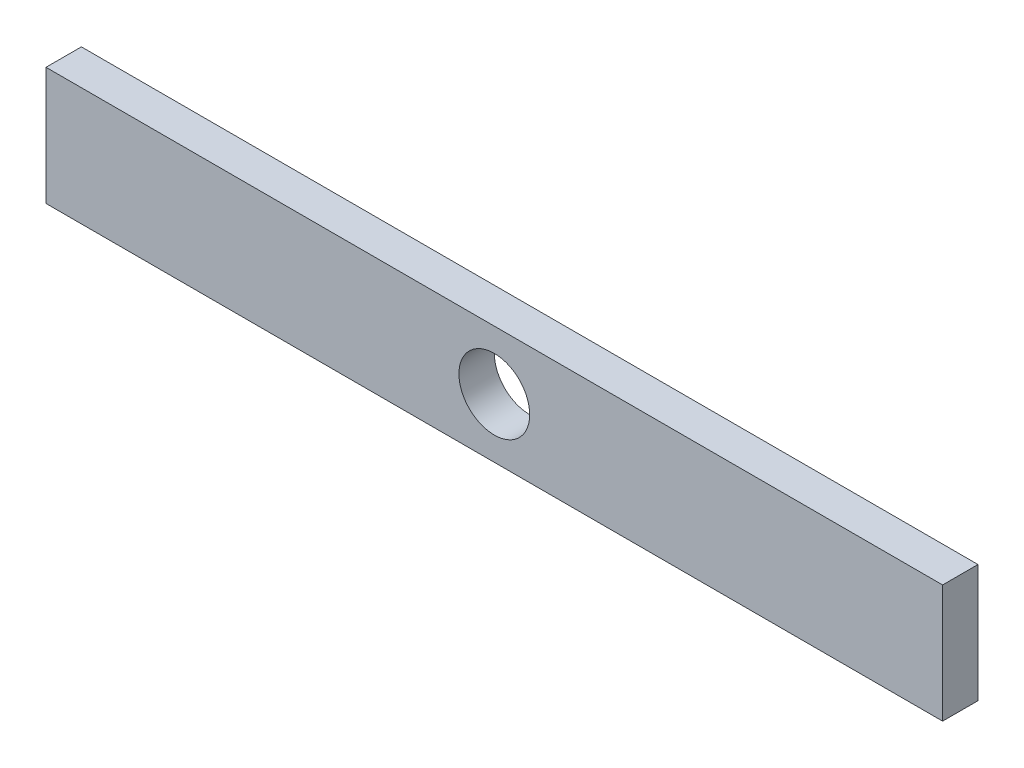
ISO-10303-21;
HEADER;
FILE_DESCRIPTION(('STEP AP214'),'2;1');
FILE_NAME('part.step','',(''),(''),'','','');
FILE_SCHEMA(('AUTOMOTIVE_DESIGN { 1 0 10303 214 1 1 1 1 }'));
ENDSEC;
DATA;
#1=APPLICATION_CONTEXT('core data for automotive mechanical design processes');
#2=APPLICATION_PROTOCOL_DEFINITION('international standard','automotive_design',2000,#1);
#3=PRODUCT_CONTEXT('',#1,'mechanical');
#4=PRODUCT('Part','Part','',(#3));
#5=PRODUCT_RELATED_PRODUCT_CATEGORY('part','',(#4));
#6=PRODUCT_DEFINITION_FORMATION('','',#4);
#7=PRODUCT_DEFINITION_CONTEXT('part definition',#1,'design');
#8=PRODUCT_DEFINITION('design','',#6,#7);
#9=PRODUCT_DEFINITION_SHAPE('','',#8);
#10=(LENGTH_UNIT() NAMED_UNIT(*) SI_UNIT(.MILLI.,.METRE.));
#11=(NAMED_UNIT(*) PLANE_ANGLE_UNIT() SI_UNIT($,.RADIAN.));
#12=(NAMED_UNIT(*) SI_UNIT($,.STERADIAN.) SOLID_ANGLE_UNIT());
#13=UNCERTAINTY_MEASURE_WITH_UNIT(LENGTH_MEASURE(1.E-05),#10,'distance_accuracy_value','');
#14=(GEOMETRIC_REPRESENTATION_CONTEXT(3) GLOBAL_UNCERTAINTY_ASSIGNED_CONTEXT((#13)) GLOBAL_UNIT_ASSIGNED_CONTEXT((#10,
#11,#12)) REPRESENTATION_CONTEXT('',''));
#15=CARTESIAN_POINT('',(0.,0.,0.));
#16=DIRECTION('',(0.,0.,1.));
#17=DIRECTION('',(1.,0.,0.));
#18=AXIS2_PLACEMENT_3D('',#15,#16,#17);
#19=CARTESIAN_POINT('',(0.,0.,3.));
#20=DIRECTION('',(0.,0.,1.));
#21=DIRECTION('',(1.,0.,0.));
#22=AXIS2_PLACEMENT_3D('',#19,#20,#21);
#23=PLANE('',#22);
#24=DIRECTION('',(0.,-1.,0.));
#25=VECTOR('',#24,1.);
#26=CARTESIAN_POINT('',(-30.2275344384877,10.,3.));
#27=LINE('',#26,#25);
#28=CARTESIAN_POINT('',(-30.2275344384877,10.,3.));
#29=VERTEX_POINT('',#28);
#30=CARTESIAN_POINT('',(-30.2275344384877,0.,3.));
#31=VERTEX_POINT('',#30);
#32=EDGE_CURVE('E92',#29,#31,#27,.T.);
#33=ORIENTED_EDGE('',*,*,#32,.T.);
#34=DIRECTION('',(1.,0.,0.));
#35=VECTOR('',#34,1.);
#36=CARTESIAN_POINT('',(-30.2275344384877,0.,3.));
#37=LINE('',#36,#35);
#38=CARTESIAN_POINT('',(45.7724655615123,0.,3.));
#39=VERTEX_POINT('',#38);
#40=EDGE_CURVE('E87',#31,#39,#37,.T.);
#41=ORIENTED_EDGE('',*,*,#40,.T.);
#42=DIRECTION('',(0.,1.,0.));
#43=VECTOR('',#42,1.);
#44=CARTESIAN_POINT('',(45.7724655615123,10.,3.));
#45=LINE('',#44,#43);
#46=CARTESIAN_POINT('',(45.7724655615123,10.,3.));
#47=VERTEX_POINT('',#46);
#48=EDGE_CURVE('E90',#39,#47,#45,.T.);
#49=ORIENTED_EDGE('',*,*,#48,.T.);
#50=DIRECTION('',(-1.,0.,0.));
#51=VECTOR('',#50,1.);
#52=CARTESIAN_POINT('',(-30.2275344384877,10.,3.));
#53=LINE('',#52,#51);
#54=EDGE_CURVE('E57',#47,#29,#53,.T.);
#55=ORIENTED_EDGE('',*,*,#54,.T.);
#56=EDGE_LOOP('',(#33,#41,#49,#55));
#57=FACE_BOUND('',#56,.T.);
#58=CARTESIAN_POINT('',(7.77246556151227,5.,3.));
#59=DIRECTION('',(0.,0.,1.));
#60=DIRECTION('',(1.,0.,0.));
#61=AXIS2_PLACEMENT_3D('',#58,#59,#60);
#62=CIRCLE('',#61,3.);
#63=CARTESIAN_POINT('',(10.7724655615123,5.,3.));
#64=VERTEX_POINT('',#63);
#65=EDGE_CURVE('E112',#64,#64,#62,.T.);
#66=ORIENTED_EDGE('',*,*,#65,.F.);
#67=EDGE_LOOP('',(#66));
#68=FACE_BOUND('',#67,.T.);
#69=ADVANCED_FACE('F39',(#57,#68),#23,.T.);
#70=CARTESIAN_POINT('',(0.,0.,0.));
#71=DIRECTION('',(0.,0.,1.));
#72=DIRECTION('',(1.,0.,0.));
#73=AXIS2_PLACEMENT_3D('',#70,#71,#72);
#74=PLANE('',#73);
#75=DIRECTION('',(0.,-1.,0.));
#76=VECTOR('',#75,1.);
#77=CARTESIAN_POINT('',(-30.2275344384877,10.,0.));
#78=LINE('',#77,#76);
#79=CARTESIAN_POINT('',(-30.2275344384877,10.,0.));
#80=VERTEX_POINT('',#79);
#81=CARTESIAN_POINT('',(-30.2275344384877,0.,0.));
#82=VERTEX_POINT('',#81);
#83=EDGE_CURVE('E108',#80,#82,#78,.T.);
#84=ORIENTED_EDGE('',*,*,#83,.F.);
#85=DIRECTION('',(-1.,0.,0.));
#86=VECTOR('',#85,1.);
#87=CARTESIAN_POINT('',(-30.2275344384877,10.,0.));
#88=LINE('',#87,#86);
#89=CARTESIAN_POINT('',(45.7724655615123,10.,0.));
#90=VERTEX_POINT('',#89);
#91=EDGE_CURVE('E80',#90,#80,#88,.T.);
#92=ORIENTED_EDGE('',*,*,#91,.F.);
#93=DIRECTION('',(0.,1.,0.));
#94=VECTOR('',#93,1.);
#95=CARTESIAN_POINT('',(45.7724655615123,10.,0.));
#96=LINE('',#95,#94);
#97=CARTESIAN_POINT('',(45.7724655615123,0.,0.));
#98=VERTEX_POINT('',#97);
#99=EDGE_CURVE('E74',#98,#90,#96,.T.);
#100=ORIENTED_EDGE('',*,*,#99,.F.);
#101=DIRECTION('',(1.,0.,0.));
#102=VECTOR('',#101,1.);
#103=CARTESIAN_POINT('',(-30.2275344384877,0.,0.));
#104=LINE('',#103,#102);
#105=EDGE_CURVE('E97',#82,#98,#104,.T.);
#106=ORIENTED_EDGE('',*,*,#105,.F.);
#107=EDGE_LOOP('',(#84,#92,#100,#106));
#108=FACE_BOUND('',#107,.T.);
#109=CARTESIAN_POINT('',(7.77246556151227,5.,0.));
#110=DIRECTION('',(0.,0.,1.));
#111=DIRECTION('',(1.,0.,0.));
#112=AXIS2_PLACEMENT_3D('',#109,#110,#111);
#113=CIRCLE('',#112,3.);
#114=CARTESIAN_POINT('',(10.7724655615123,5.,0.));
#115=VERTEX_POINT('',#114);
#116=EDGE_CURVE('E130',#115,#115,#113,.T.);
#117=ORIENTED_EDGE('',*,*,#116,.T.);
#118=EDGE_LOOP('',(#117));
#119=FACE_BOUND('',#118,.T.);
#120=ADVANCED_FACE('F125',(#108,#119),#74,.F.);
#121=CARTESIAN_POINT('',(-30.2275344384877,10.,3.));
#122=DIRECTION('',(1.,0.,0.));
#123=DIRECTION('',(0.,0.,-1.));
#124=AXIS2_PLACEMENT_3D('',#121,#122,#123);
#125=PLANE('',#124);
#126=ORIENTED_EDGE('',*,*,#83,.T.);
#127=DIRECTION('',(0.,0.,-1.));
#128=VECTOR('',#127,1.);
#129=CARTESIAN_POINT('',(-30.2275344384877,0.,3.));
#130=LINE('',#129,#128);
#131=EDGE_CURVE('E11',#31,#82,#130,.T.);
#132=ORIENTED_EDGE('',*,*,#131,.F.);
#133=ORIENTED_EDGE('',*,*,#32,.F.);
#134=DIRECTION('',(0.,0.,-1.));
#135=VECTOR('',#134,1.);
#136=CARTESIAN_POINT('',(-30.2275344384877,10.,3.));
#137=LINE('',#136,#135);
#138=EDGE_CURVE('E104',#29,#80,#137,.T.);
#139=ORIENTED_EDGE('',*,*,#138,.T.);
#140=EDGE_LOOP('',(#126,#132,#133,#139));
#141=FACE_BOUND('',#140,.T.);
#142=ADVANCED_FACE('F41',(#141),#125,.F.);
#143=CARTESIAN_POINT('',(-30.2275344384877,0.,3.));
#144=DIRECTION('',(0.,1.,0.));
#145=DIRECTION('',(0.,0.,1.));
#146=AXIS2_PLACEMENT_3D('',#143,#144,#145);
#147=PLANE('',#146);
#148=ORIENTED_EDGE('',*,*,#105,.T.);
#149=DIRECTION('',(0.,0.,-1.));
#150=VECTOR('',#149,1.);
#151=CARTESIAN_POINT('',(45.7724655615123,0.,3.));
#152=LINE('',#151,#150);
#153=EDGE_CURVE('E49',#39,#98,#152,.T.);
#154=ORIENTED_EDGE('',*,*,#153,.F.);
#155=ORIENTED_EDGE('',*,*,#40,.F.);
#156=ORIENTED_EDGE('',*,*,#131,.T.);
#157=EDGE_LOOP('',(#148,#154,#155,#156));
#158=FACE_BOUND('',#157,.T.);
#159=ADVANCED_FACE('F96',(#158),#147,.F.);
#160=CARTESIAN_POINT('',(45.7724655615123,10.,3.));
#161=DIRECTION('',(-1.,0.,0.));
#162=DIRECTION('',(0.,0.,1.));
#163=AXIS2_PLACEMENT_3D('',#160,#161,#162);
#164=PLANE('',#163);
#165=ORIENTED_EDGE('',*,*,#99,.T.);
#166=DIRECTION('',(0.,0.,-1.));
#167=VECTOR('',#166,1.);
#168=CARTESIAN_POINT('',(45.7724655615123,10.,3.));
#169=LINE('',#168,#167);
#170=EDGE_CURVE('E99',#47,#90,#169,.T.);
#171=ORIENTED_EDGE('',*,*,#170,.F.);
#172=ORIENTED_EDGE('',*,*,#48,.F.);
#173=ORIENTED_EDGE('',*,*,#153,.T.);
#174=EDGE_LOOP('',(#165,#171,#172,#173));
#175=FACE_BOUND('',#174,.T.);
#176=ADVANCED_FACE('F100',(#175),#164,.F.);
#177=CARTESIAN_POINT('',(-30.2275344384877,10.,3.));
#178=DIRECTION('',(0.,-1.,0.));
#179=DIRECTION('',(0.,0.,-1.));
#180=AXIS2_PLACEMENT_3D('',#177,#178,#179);
#181=PLANE('',#180);
#182=ORIENTED_EDGE('',*,*,#91,.T.);
#183=ORIENTED_EDGE('',*,*,#138,.F.);
#184=ORIENTED_EDGE('',*,*,#54,.F.);
#185=ORIENTED_EDGE('',*,*,#170,.T.);
#186=EDGE_LOOP('',(#182,#183,#184,#185));
#187=FACE_BOUND('',#186,.T.);
#188=ADVANCED_FACE('F122',(#187),#181,.F.);
#189=CARTESIAN_POINT('',(7.77246556151227,5.,3.));
#190=DIRECTION('',(0.,0.,-1.));
#191=DIRECTION('',(-1.,0.,0.));
#192=AXIS2_PLACEMENT_3D('',#189,#190,#191);
#193=CYLINDRICAL_SURFACE('',#192,3.);
#194=ORIENTED_EDGE('',*,*,#65,.T.);
#195=EDGE_LOOP('',(#194));
#196=FACE_BOUND('',#195,.T.);
#197=ORIENTED_EDGE('',*,*,#116,.F.);
#198=EDGE_LOOP('',(#197));
#199=FACE_BOUND('',#198,.T.);
#200=ADVANCED_FACE('F138',(#196,#199),#193,.F.);
#201=CLOSED_SHELL('',(#69,#120,#142,#159,#176,#188,#200));
#202=MANIFOLD_SOLID_BREP('B2',#201);
#203=ADVANCED_BREP_SHAPE_REPRESENTATION('',(#18,#202),#14);
#204=SHAPE_DEFINITION_REPRESENTATION(#9,#203);
ENDSEC;
END-ISO-10303-21;
